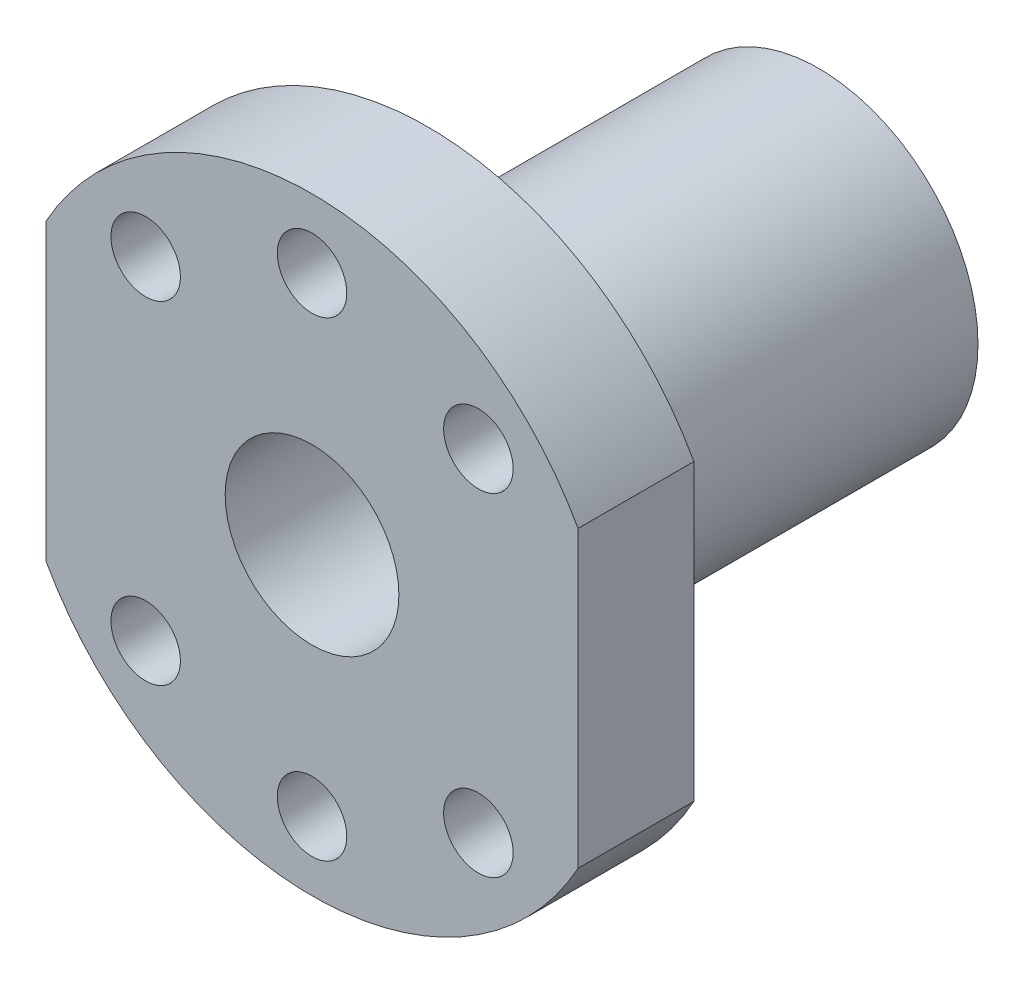
ISO-10303-21;
HEADER;
FILE_DESCRIPTION(('STEP AP214'),'2;1');
FILE_NAME('part.step','',(''),(''),'','','');
FILE_SCHEMA(('AUTOMOTIVE_DESIGN { 1 0 10303 214 1 1 1 1 }'));
ENDSEC;
DATA;
#1=APPLICATION_CONTEXT('core data for automotive mechanical design processes');
#2=APPLICATION_PROTOCOL_DEFINITION('international standard','automotive_design',2000,#1);
#3=PRODUCT_CONTEXT('',#1,'mechanical');
#4=PRODUCT('Part','Part','',(#3));
#5=PRODUCT_RELATED_PRODUCT_CATEGORY('part','',(#4));
#6=PRODUCT_DEFINITION_FORMATION('','',#4);
#7=PRODUCT_DEFINITION_CONTEXT('part definition',#1,'design');
#8=PRODUCT_DEFINITION('design','',#6,#7);
#9=PRODUCT_DEFINITION_SHAPE('','',#8);
#10=(LENGTH_UNIT() NAMED_UNIT(*) SI_UNIT(.MILLI.,.METRE.));
#11=(NAMED_UNIT(*) PLANE_ANGLE_UNIT() SI_UNIT($,.RADIAN.));
#12=(NAMED_UNIT(*) SI_UNIT($,.STERADIAN.) SOLID_ANGLE_UNIT());
#13=UNCERTAINTY_MEASURE_WITH_UNIT(LENGTH_MEASURE(1.E-05),#10,'distance_accuracy_value','');
#14=(GEOMETRIC_REPRESENTATION_CONTEXT(3) GLOBAL_UNCERTAINTY_ASSIGNED_CONTEXT((#13)) GLOBAL_UNIT_ASSIGNED_CONTEXT((#10,
#11,#12)) REPRESENTATION_CONTEXT('',''));
#15=CARTESIAN_POINT('',(0.,0.,0.));
#16=DIRECTION('',(0.,0.,1.));
#17=DIRECTION('',(1.,0.,0.));
#18=AXIS2_PLACEMENT_3D('',#15,#16,#17);
#19=CARTESIAN_POINT('',(0.,0.,-4.));
#20=DIRECTION('',(0.,0.,1.));
#21=DIRECTION('',(1.,0.,0.));
#22=AXIS2_PLACEMENT_3D('',#19,#20,#21);
#23=PLANE('',#22);
#24=CARTESIAN_POINT('',(0.,0.,-4.));
#25=DIRECTION('',(0.,0.,1.));
#26=DIRECTION('',(1.,0.,0.));
#27=AXIS2_PLACEMENT_3D('',#24,#25,#26);
#28=CIRCLE('',#27,21.);
#29=CARTESIAN_POINT('',(-18.375,-10.1665812837945,-4.));
#30=VERTEX_POINT('',#29);
#31=CARTESIAN_POINT('',(18.375,-10.1665812837945,-4.));
#32=VERTEX_POINT('',#31);
#33=EDGE_CURVE('E100',#30,#32,#28,.T.);
#34=ORIENTED_EDGE('',*,*,#33,.F.);
#35=DIRECTION('',(0.,-1.,0.));
#36=VECTOR('',#35,1.);
#37=CARTESIAN_POINT('',(-18.375,10.1665812837945,-4.));
#38=LINE('',#37,#36);
#39=CARTESIAN_POINT('',(-18.375,10.1665812837945,-4.));
#40=VERTEX_POINT('',#39);
#41=EDGE_CURVE('E72',#40,#30,#38,.T.);
#42=ORIENTED_EDGE('',*,*,#41,.F.);
#43=CARTESIAN_POINT('',(0.,0.,-4.));
#44=DIRECTION('',(0.,0.,1.));
#45=DIRECTION('',(1.,0.,0.));
#46=AXIS2_PLACEMENT_3D('',#43,#44,#45);
#47=CIRCLE('',#46,21.);
#48=CARTESIAN_POINT('',(18.375,10.1665812837945,-4.));
#49=VERTEX_POINT('',#48);
#50=EDGE_CURVE('E66',#49,#40,#47,.T.);
#51=ORIENTED_EDGE('',*,*,#50,.F.);
#52=DIRECTION('',(0.,1.,0.));
#53=VECTOR('',#52,1.);
#54=CARTESIAN_POINT('',(18.375,10.1665812837945,-4.));
#55=LINE('',#54,#53);
#56=EDGE_CURVE('E91',#32,#49,#55,.T.);
#57=ORIENTED_EDGE('',*,*,#56,.F.);
#58=EDGE_LOOP('',(#34,#42,#51,#57));
#59=FACE_BOUND('',#58,.T.);
#60=CARTESIAN_POINT('',(-11.4904851942813,11.4904851942815,-4.));
#61=DIRECTION('',(0.,0.,1.));
#62=DIRECTION('',(1.,0.,0.));
#63=AXIS2_PLACEMENT_3D('',#60,#61,#62);
#64=CIRCLE('',#63,2.4);
#65=CARTESIAN_POINT('',(-9.09048519428134,11.4904851942815,-4.));
#66=VERTEX_POINT('',#65);
#67=EDGE_CURVE('E117',#66,#66,#64,.T.);
#68=ORIENTED_EDGE('',*,*,#67,.T.);
#69=EDGE_LOOP('',(#68));
#70=FACE_BOUND('',#69,.T.);
#71=CARTESIAN_POINT('',(0.,16.25,-4.));
#72=DIRECTION('',(0.,0.,1.));
#73=DIRECTION('',(1.,0.,0.));
#74=AXIS2_PLACEMENT_3D('',#71,#72,#73);
#75=CIRCLE('',#74,2.4);
#76=CARTESIAN_POINT('',(2.4,16.25,-4.));
#77=VERTEX_POINT('',#76);
#78=EDGE_CURVE('E121',#77,#77,#75,.T.);
#79=ORIENTED_EDGE('',*,*,#78,.T.);
#80=EDGE_LOOP('',(#79));
#81=FACE_BOUND('',#80,.T.);
#82=CARTESIAN_POINT('',(11.4904851942813,11.4904851942815,-4.));
#83=DIRECTION('',(0.,0.,1.));
#84=DIRECTION('',(1.,0.,0.));
#85=AXIS2_PLACEMENT_3D('',#82,#83,#84);
#86=CIRCLE('',#85,2.4);
#87=CARTESIAN_POINT('',(13.8904851942813,11.4904851942815,-4.));
#88=VERTEX_POINT('',#87);
#89=EDGE_CURVE('E125',#88,#88,#86,.T.);
#90=ORIENTED_EDGE('',*,*,#89,.T.);
#91=EDGE_LOOP('',(#90));
#92=FACE_BOUND('',#91,.T.);
#93=CARTESIAN_POINT('',(11.4904851942813,-11.4904851942815,-4.));
#94=DIRECTION('',(0.,0.,1.));
#95=DIRECTION('',(1.,0.,0.));
#96=AXIS2_PLACEMENT_3D('',#93,#94,#95);
#97=CIRCLE('',#96,2.4);
#98=CARTESIAN_POINT('',(13.8904851942813,-11.4904851942815,-4.));
#99=VERTEX_POINT('',#98);
#100=EDGE_CURVE('E129',#99,#99,#97,.T.);
#101=ORIENTED_EDGE('',*,*,#100,.T.);
#102=EDGE_LOOP('',(#101));
#103=FACE_BOUND('',#102,.T.);
#104=CARTESIAN_POINT('',(0.,-16.25,-4.));
#105=DIRECTION('',(0.,0.,1.));
#106=DIRECTION('',(1.,0.,0.));
#107=AXIS2_PLACEMENT_3D('',#104,#105,#106);
#108=CIRCLE('',#107,2.4);
#109=CARTESIAN_POINT('',(2.4,-16.25,-4.));
#110=VERTEX_POINT('',#109);
#111=EDGE_CURVE('E133',#110,#110,#108,.T.);
#112=ORIENTED_EDGE('',*,*,#111,.T.);
#113=EDGE_LOOP('',(#112));
#114=FACE_BOUND('',#113,.T.);
#115=CARTESIAN_POINT('',(-11.4904851942813,-11.4904851942815,-4.));
#116=DIRECTION('',(0.,0.,1.));
#117=DIRECTION('',(1.,0.,0.));
#118=AXIS2_PLACEMENT_3D('',#115,#116,#117);
#119=CIRCLE('',#118,2.4);
#120=CARTESIAN_POINT('',(-9.09048519428133,-11.4904851942815,-4.));
#121=VERTEX_POINT('',#120);
#122=EDGE_CURVE('E137',#121,#121,#119,.T.);
#123=ORIENTED_EDGE('',*,*,#122,.T.);
#124=EDGE_LOOP('',(#123));
#125=FACE_BOUND('',#124,.T.);
#126=CARTESIAN_POINT('',(0.,0.,-4.));
#127=DIRECTION('',(0.,0.,1.));
#128=DIRECTION('',(1.,0.,0.));
#129=AXIS2_PLACEMENT_3D('',#126,#127,#128);
#130=CIRCLE('',#129,11.);
#131=CARTESIAN_POINT('',(11.,0.,-4.));
#132=VERTEX_POINT('',#131);
#133=EDGE_CURVE('E11',#132,#132,#130,.F.);
#134=ORIENTED_EDGE('',*,*,#133,.F.);
#135=EDGE_LOOP('',(#134));
#136=FACE_BOUND('',#135,.T.);
#137=ADVANCED_FACE('F32',(#59,#70,#81,#92,#103,#114,#125,#136),#23,.F.);
#138=CARTESIAN_POINT('',(0.,0.,4.));
#139=DIRECTION('',(0.,0.,1.));
#140=DIRECTION('',(1.,0.,0.));
#141=AXIS2_PLACEMENT_3D('',#138,#139,#140);
#142=PLANE('',#141);
#143=CARTESIAN_POINT('',(-11.4904851942813,-11.4904851942815,4.));
#144=DIRECTION('',(0.,0.,1.));
#145=DIRECTION('',(1.,0.,0.));
#146=AXIS2_PLACEMENT_3D('',#143,#144,#145);
#147=CIRCLE('',#146,2.4);
#148=CARTESIAN_POINT('',(-9.09048519428133,-11.4904851942815,4.));
#149=VERTEX_POINT('',#148);
#150=EDGE_CURVE('E283',#149,#149,#147,.T.);
#151=ORIENTED_EDGE('',*,*,#150,.F.);
#152=EDGE_LOOP('',(#151));
#153=FACE_BOUND('',#152,.T.);
#154=CARTESIAN_POINT('',(0.,-16.25,4.));
#155=DIRECTION('',(0.,0.,1.));
#156=DIRECTION('',(1.,0.,0.));
#157=AXIS2_PLACEMENT_3D('',#154,#155,#156);
#158=CIRCLE('',#157,2.4);
#159=CARTESIAN_POINT('',(2.4,-16.25,4.));
#160=VERTEX_POINT('',#159);
#161=EDGE_CURVE('E287',#160,#160,#158,.T.);
#162=ORIENTED_EDGE('',*,*,#161,.F.);
#163=EDGE_LOOP('',(#162));
#164=FACE_BOUND('',#163,.T.);
#165=CARTESIAN_POINT('',(11.4904851942813,-11.4904851942815,4.));
#166=DIRECTION('',(0.,0.,1.));
#167=DIRECTION('',(1.,0.,0.));
#168=AXIS2_PLACEMENT_3D('',#165,#166,#167);
#169=CIRCLE('',#168,2.4);
#170=CARTESIAN_POINT('',(13.8904851942813,-11.4904851942815,4.));
#171=VERTEX_POINT('',#170);
#172=EDGE_CURVE('E291',#171,#171,#169,.T.);
#173=ORIENTED_EDGE('',*,*,#172,.F.);
#174=EDGE_LOOP('',(#173));
#175=FACE_BOUND('',#174,.T.);
#176=CARTESIAN_POINT('',(11.4904851942813,11.4904851942815,4.));
#177=DIRECTION('',(0.,0.,1.));
#178=DIRECTION('',(1.,0.,0.));
#179=AXIS2_PLACEMENT_3D('',#176,#177,#178);
#180=CIRCLE('',#179,2.4);
#181=CARTESIAN_POINT('',(13.8904851942813,11.4904851942815,4.));
#182=VERTEX_POINT('',#181);
#183=EDGE_CURVE('E295',#182,#182,#180,.T.);
#184=ORIENTED_EDGE('',*,*,#183,.F.);
#185=EDGE_LOOP('',(#184));
#186=FACE_BOUND('',#185,.T.);
#187=CARTESIAN_POINT('',(0.,16.25,4.));
#188=DIRECTION('',(0.,0.,1.));
#189=DIRECTION('',(1.,0.,0.));
#190=AXIS2_PLACEMENT_3D('',#187,#188,#189);
#191=CIRCLE('',#190,2.4);
#192=CARTESIAN_POINT('',(2.4,16.25,4.));
#193=VERTEX_POINT('',#192);
#194=EDGE_CURVE('E299',#193,#193,#191,.T.);
#195=ORIENTED_EDGE('',*,*,#194,.F.);
#196=EDGE_LOOP('',(#195));
#197=FACE_BOUND('',#196,.T.);
#198=CARTESIAN_POINT('',(-11.4904851942813,11.4904851942815,4.));
#199=DIRECTION('',(0.,0.,1.));
#200=DIRECTION('',(1.,0.,0.));
#201=AXIS2_PLACEMENT_3D('',#198,#199,#200);
#202=CIRCLE('',#201,2.4);
#203=CARTESIAN_POINT('',(-9.09048519428134,11.4904851942815,4.));
#204=VERTEX_POINT('',#203);
#205=EDGE_CURVE('E302',#204,#204,#202,.T.);
#206=ORIENTED_EDGE('',*,*,#205,.F.);
#207=EDGE_LOOP('',(#206));
#208=FACE_BOUND('',#207,.T.);
#209=CARTESIAN_POINT('',(0.,0.,4.));
#210=DIRECTION('',(0.,0.,1.));
#211=DIRECTION('',(1.,0.,0.));
#212=AXIS2_PLACEMENT_3D('',#209,#210,#211);
#213=CIRCLE('',#212,21.);
#214=CARTESIAN_POINT('',(-18.375,-10.1665812837945,4.));
#215=VERTEX_POINT('',#214);
#216=CARTESIAN_POINT('',(18.375,-10.1665812837945,4.));
#217=VERTEX_POINT('',#216);
#218=EDGE_CURVE('E86',#215,#217,#213,.T.);
#219=ORIENTED_EDGE('',*,*,#218,.T.);
#220=DIRECTION('',(0.,1.,0.));
#221=VECTOR('',#220,1.);
#222=CARTESIAN_POINT('',(18.375,10.1665812837945,4.));
#223=LINE('',#222,#221);
#224=CARTESIAN_POINT('',(18.375,10.1665812837945,4.));
#225=VERTEX_POINT('',#224);
#226=EDGE_CURVE('E80',#217,#225,#223,.T.);
#227=ORIENTED_EDGE('',*,*,#226,.T.);
#228=CARTESIAN_POINT('',(0.,0.,4.));
#229=DIRECTION('',(0.,0.,1.));
#230=DIRECTION('',(1.,0.,0.));
#231=AXIS2_PLACEMENT_3D('',#228,#229,#230);
#232=CIRCLE('',#231,21.);
#233=CARTESIAN_POINT('',(-18.375,10.1665812837945,4.));
#234=VERTEX_POINT('',#233);
#235=EDGE_CURVE('E84',#225,#234,#232,.T.);
#236=ORIENTED_EDGE('',*,*,#235,.T.);
#237=DIRECTION('',(0.,-1.,0.));
#238=VECTOR('',#237,1.);
#239=CARTESIAN_POINT('',(-18.375,10.1665812837945,4.));
#240=LINE('',#239,#238);
#241=EDGE_CURVE('E49',#234,#215,#240,.T.);
#242=ORIENTED_EDGE('',*,*,#241,.T.);
#243=EDGE_LOOP('',(#219,#227,#236,#242));
#244=FACE_BOUND('',#243,.T.);
#245=CARTESIAN_POINT('',(0.,0.,4.));
#246=DIRECTION('',(0.,0.,1.));
#247=DIRECTION('',(1.,0.,0.));
#248=AXIS2_PLACEMENT_3D('',#245,#246,#247);
#249=CIRCLE('',#248,6.);
#250=CARTESIAN_POINT('',(6.,0.,4.));
#251=VERTEX_POINT('',#250);
#252=EDGE_CURVE('E103',#251,#251,#249,.T.);
#253=ORIENTED_EDGE('',*,*,#252,.F.);
#254=EDGE_LOOP('',(#253));
#255=FACE_BOUND('',#254,.T.);
#256=ADVANCED_FACE('F81',(#153,#164,#175,#186,#197,#208,#244,#255),#142,.T.);
#257=CARTESIAN_POINT('',(0.,0.,4.));
#258=DIRECTION('',(0.,0.,-1.));
#259=DIRECTION('',(-1.,0.,0.));
#260=AXIS2_PLACEMENT_3D('',#257,#258,#259);
#261=CYLINDRICAL_SURFACE('',#260,21.);
#262=ORIENTED_EDGE('',*,*,#33,.T.);
#263=DIRECTION('',(0.,0.,-1.));
#264=VECTOR('',#263,1.);
#265=CARTESIAN_POINT('',(18.375,-10.1665812837945,4.));
#266=LINE('',#265,#264);
#267=EDGE_CURVE('E41',#217,#32,#266,.T.);
#268=ORIENTED_EDGE('',*,*,#267,.F.);
#269=ORIENTED_EDGE('',*,*,#218,.F.);
#270=DIRECTION('',(0.,0.,-1.));
#271=VECTOR('',#270,1.);
#272=CARTESIAN_POINT('',(-18.375,-10.1665812837945,4.));
#273=LINE('',#272,#271);
#274=EDGE_CURVE('E96',#215,#30,#273,.T.);
#275=ORIENTED_EDGE('',*,*,#274,.T.);
#276=EDGE_LOOP('',(#262,#268,#269,#275));
#277=FACE_BOUND('',#276,.T.);
#278=ADVANCED_FACE('F34',(#277),#261,.T.);
#279=CARTESIAN_POINT('',(18.375,10.1665812837945,4.));
#280=DIRECTION('',(-1.,0.,0.));
#281=DIRECTION('',(0.,0.,1.));
#282=AXIS2_PLACEMENT_3D('',#279,#280,#281);
#283=PLANE('',#282);
#284=ORIENTED_EDGE('',*,*,#56,.T.);
#285=DIRECTION('',(0.,0.,-1.));
#286=VECTOR('',#285,1.);
#287=CARTESIAN_POINT('',(18.375,10.1665812837945,4.));
#288=LINE('',#287,#286);
#289=EDGE_CURVE('E89',#225,#49,#288,.T.);
#290=ORIENTED_EDGE('',*,*,#289,.F.);
#291=ORIENTED_EDGE('',*,*,#226,.F.);
#292=ORIENTED_EDGE('',*,*,#267,.T.);
#293=EDGE_LOOP('',(#284,#290,#291,#292));
#294=FACE_BOUND('',#293,.T.);
#295=ADVANCED_FACE('F90',(#294),#283,.F.);
#296=CARTESIAN_POINT('',(0.,0.,4.));
#297=DIRECTION('',(0.,0.,-1.));
#298=DIRECTION('',(-1.,0.,0.));
#299=AXIS2_PLACEMENT_3D('',#296,#297,#298);
#300=CYLINDRICAL_SURFACE('',#299,21.);
#301=ORIENTED_EDGE('',*,*,#50,.T.);
#302=DIRECTION('',(0.,0.,-1.));
#303=VECTOR('',#302,1.);
#304=CARTESIAN_POINT('',(-18.375,10.1665812837945,4.));
#305=LINE('',#304,#303);
#306=EDGE_CURVE('E92',#234,#40,#305,.T.);
#307=ORIENTED_EDGE('',*,*,#306,.F.);
#308=ORIENTED_EDGE('',*,*,#235,.F.);
#309=ORIENTED_EDGE('',*,*,#289,.T.);
#310=EDGE_LOOP('',(#301,#307,#308,#309));
#311=FACE_BOUND('',#310,.T.);
#312=ADVANCED_FACE('F94',(#311),#300,.T.);
#313=CARTESIAN_POINT('',(-18.375,10.1665812837945,4.));
#314=DIRECTION('',(1.,0.,0.));
#315=DIRECTION('',(0.,0.,-1.));
#316=AXIS2_PLACEMENT_3D('',#313,#314,#315);
#317=PLANE('',#316);
#318=ORIENTED_EDGE('',*,*,#41,.T.);
#319=ORIENTED_EDGE('',*,*,#274,.F.);
#320=ORIENTED_EDGE('',*,*,#241,.F.);
#321=ORIENTED_EDGE('',*,*,#306,.T.);
#322=EDGE_LOOP('',(#318,#319,#320,#321));
#323=FACE_BOUND('',#322,.T.);
#324=ADVANCED_FACE('F179',(#323),#317,.F.);
#325=CARTESIAN_POINT('',(0.,0.,4.));
#326=DIRECTION('',(0.,0.,-1.));
#327=DIRECTION('',(-1.,0.,0.));
#328=AXIS2_PLACEMENT_3D('',#325,#326,#327);
#329=CYLINDRICAL_SURFACE('',#328,6.);
#330=ORIENTED_EDGE('',*,*,#252,.T.);
#331=EDGE_LOOP('',(#330));
#332=FACE_BOUND('',#331,.T.);
#333=CARTESIAN_POINT('',(0.,0.,-31.));
#334=DIRECTION('',(0.,0.,-1.));
#335=DIRECTION('',(-1.,0.,0.));
#336=AXIS2_PLACEMENT_3D('',#333,#334,#335);
#337=CIRCLE('',#336,6.);
#338=CARTESIAN_POINT('',(-6.,0.,-31.));
#339=VERTEX_POINT('',#338);
#340=EDGE_CURVE('E314',#339,#339,#337,.T.);
#341=ORIENTED_EDGE('',*,*,#340,.T.);
#342=EDGE_LOOP('',(#341));
#343=FACE_BOUND('',#342,.T.);
#344=ADVANCED_FACE('F175',(#332,#343),#329,.F.);
#345=CARTESIAN_POINT('',(-11.4904851942813,11.4904851942815,-4.));
#346=DIRECTION('',(0.,0.,1.));
#347=DIRECTION('',(1.,0.,0.));
#348=AXIS2_PLACEMENT_3D('',#345,#346,#347);
#349=CYLINDRICAL_SURFACE('',#348,2.4);
#350=ORIENTED_EDGE('',*,*,#67,.F.);
#351=EDGE_LOOP('',(#350));
#352=FACE_BOUND('',#351,.T.);
#353=ORIENTED_EDGE('',*,*,#205,.T.);
#354=EDGE_LOOP('',(#353));
#355=FACE_BOUND('',#354,.T.);
#356=ADVANCED_FACE('F171',(#352,#355),#349,.F.);
#357=CARTESIAN_POINT('',(0.,16.25,-4.));
#358=DIRECTION('',(0.,0.,1.));
#359=DIRECTION('',(1.,0.,0.));
#360=AXIS2_PLACEMENT_3D('',#357,#358,#359);
#361=CYLINDRICAL_SURFACE('',#360,2.4);
#362=ORIENTED_EDGE('',*,*,#78,.F.);
#363=EDGE_LOOP('',(#362));
#364=FACE_BOUND('',#363,.T.);
#365=ORIENTED_EDGE('',*,*,#194,.T.);
#366=EDGE_LOOP('',(#365));
#367=FACE_BOUND('',#366,.T.);
#368=ADVANCED_FACE('F167',(#364,#367),#361,.F.);
#369=CARTESIAN_POINT('',(11.4904851942813,11.4904851942815,-4.));
#370=DIRECTION('',(0.,0.,1.));
#371=DIRECTION('',(1.,0.,0.));
#372=AXIS2_PLACEMENT_3D('',#369,#370,#371);
#373=CYLINDRICAL_SURFACE('',#372,2.4);
#374=ORIENTED_EDGE('',*,*,#89,.F.);
#375=EDGE_LOOP('',(#374));
#376=FACE_BOUND('',#375,.T.);
#377=ORIENTED_EDGE('',*,*,#183,.T.);
#378=EDGE_LOOP('',(#377));
#379=FACE_BOUND('',#378,.T.);
#380=ADVANCED_FACE('F163',(#376,#379),#373,.F.);
#381=CARTESIAN_POINT('',(11.4904851942813,-11.4904851942815,-4.));
#382=DIRECTION('',(0.,0.,1.));
#383=DIRECTION('',(1.,0.,0.));
#384=AXIS2_PLACEMENT_3D('',#381,#382,#383);
#385=CYLINDRICAL_SURFACE('',#384,2.4);
#386=ORIENTED_EDGE('',*,*,#100,.F.);
#387=EDGE_LOOP('',(#386));
#388=FACE_BOUND('',#387,.T.);
#389=ORIENTED_EDGE('',*,*,#172,.T.);
#390=EDGE_LOOP('',(#389));
#391=FACE_BOUND('',#390,.T.);
#392=ADVANCED_FACE('F159',(#388,#391),#385,.F.);
#393=CARTESIAN_POINT('',(0.,-16.25,-4.));
#394=DIRECTION('',(0.,0.,1.));
#395=DIRECTION('',(1.,0.,0.));
#396=AXIS2_PLACEMENT_3D('',#393,#394,#395);
#397=CYLINDRICAL_SURFACE('',#396,2.4);
#398=ORIENTED_EDGE('',*,*,#111,.F.);
#399=EDGE_LOOP('',(#398));
#400=FACE_BOUND('',#399,.T.);
#401=ORIENTED_EDGE('',*,*,#161,.T.);
#402=EDGE_LOOP('',(#401));
#403=FACE_BOUND('',#402,.T.);
#404=ADVANCED_FACE('F155',(#400,#403),#397,.F.);
#405=CARTESIAN_POINT('',(-11.4904851942813,-11.4904851942815,-4.));
#406=DIRECTION('',(0.,0.,1.));
#407=DIRECTION('',(1.,0.,0.));
#408=AXIS2_PLACEMENT_3D('',#405,#406,#407);
#409=CYLINDRICAL_SURFACE('',#408,2.4);
#410=ORIENTED_EDGE('',*,*,#122,.F.);
#411=EDGE_LOOP('',(#410));
#412=FACE_BOUND('',#411,.T.);
#413=ORIENTED_EDGE('',*,*,#150,.T.);
#414=EDGE_LOOP('',(#413));
#415=FACE_BOUND('',#414,.T.);
#416=ADVANCED_FACE('F148',(#412,#415),#409,.F.);
#417=CARTESIAN_POINT('',(0.,0.,-31.));
#418=DIRECTION('',(0.,0.,-1.));
#419=DIRECTION('',(-1.,0.,0.));
#420=AXIS2_PLACEMENT_3D('',#417,#418,#419);
#421=PLANE('',#420);
#422=CARTESIAN_POINT('',(0.,0.,-31.));
#423=DIRECTION('',(0.,0.,-1.));
#424=DIRECTION('',(-1.,0.,0.));
#425=AXIS2_PLACEMENT_3D('',#422,#423,#424);
#426=CIRCLE('',#425,11.);
#427=CARTESIAN_POINT('',(-11.,0.,-31.));
#428=VERTEX_POINT('',#427);
#429=EDGE_CURVE('E316',#428,#428,#426,.T.);
#430=ORIENTED_EDGE('',*,*,#429,.T.);
#431=EDGE_LOOP('',(#430));
#432=FACE_BOUND('',#431,.T.);
#433=ORIENTED_EDGE('',*,*,#340,.F.);
#434=EDGE_LOOP('',(#433));
#435=FACE_BOUND('',#434,.T.);
#436=ADVANCED_FACE('F142',(#432,#435),#421,.T.);
#437=CARTESIAN_POINT('',(0.,0.,-31.));
#438=DIRECTION('',(0.,0.,1.));
#439=DIRECTION('',(1.,0.,0.));
#440=AXIS2_PLACEMENT_3D('',#437,#438,#439);
#441=CYLINDRICAL_SURFACE('',#440,11.);
#442=ORIENTED_EDGE('',*,*,#429,.F.);
#443=EDGE_LOOP('',(#442));
#444=FACE_BOUND('',#443,.T.);
#445=ORIENTED_EDGE('',*,*,#133,.T.);
#446=EDGE_LOOP('',(#445));
#447=FACE_BOUND('',#446,.T.);
#448=ADVANCED_FACE('F140',(#444,#447),#441,.T.);
#449=CLOSED_SHELL('',(#137,#256,#278,#295,#312,#324,#344,#356,#368,#380,#392,#404,#416,#436,#448));
#450=MANIFOLD_SOLID_BREP('B2',#449);
#451=ADVANCED_BREP_SHAPE_REPRESENTATION('',(#18,#450),#14);
#452=SHAPE_DEFINITION_REPRESENTATION(#9,#451);
ENDSEC;
END-ISO-10303-21;
